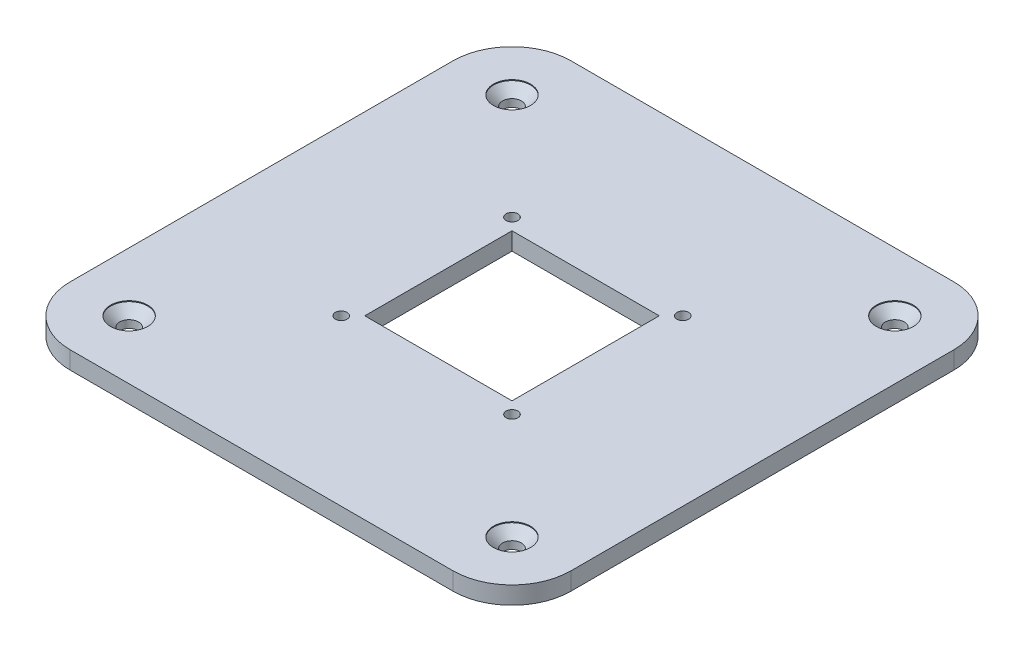
ISO-10303-21;
HEADER;
FILE_DESCRIPTION(('STEP AP214'),'2;1');
FILE_NAME('part.step','',(''),(''),'','','');
FILE_SCHEMA(('AUTOMOTIVE_DESIGN { 1 0 10303 214 1 1 1 1 }'));
ENDSEC;
DATA;
#1=APPLICATION_CONTEXT('core data for automotive mechanical design processes');
#2=APPLICATION_PROTOCOL_DEFINITION('international standard','automotive_design',2000,#1);
#3=PRODUCT_CONTEXT('',#1,'mechanical');
#4=PRODUCT('Part','Part','',(#3));
#5=PRODUCT_RELATED_PRODUCT_CATEGORY('part','',(#4));
#6=PRODUCT_DEFINITION_FORMATION('','',#4);
#7=PRODUCT_DEFINITION_CONTEXT('part definition',#1,'design');
#8=PRODUCT_DEFINITION('design','',#6,#7);
#9=PRODUCT_DEFINITION_SHAPE('','',#8);
#10=(LENGTH_UNIT() NAMED_UNIT(*) SI_UNIT(.MILLI.,.METRE.));
#11=(NAMED_UNIT(*) PLANE_ANGLE_UNIT() SI_UNIT($,.RADIAN.));
#12=(NAMED_UNIT(*) SI_UNIT($,.STERADIAN.) SOLID_ANGLE_UNIT());
#13=UNCERTAINTY_MEASURE_WITH_UNIT(LENGTH_MEASURE(1.E-05),#10,'distance_accuracy_value','');
#14=(GEOMETRIC_REPRESENTATION_CONTEXT(3) GLOBAL_UNCERTAINTY_ASSIGNED_CONTEXT((#13)) GLOBAL_UNIT_ASSIGNED_CONTEXT((#10,
#11,#12)) REPRESENTATION_CONTEXT('',''));
#15=CARTESIAN_POINT('',(0.,0.,0.));
#16=DIRECTION('',(0.,0.,1.));
#17=DIRECTION('',(1.,0.,0.));
#18=AXIS2_PLACEMENT_3D('',#15,#16,#17);
#19=CARTESIAN_POINT('',(42.5,3.,42.5));
#20=DIRECTION('',(-1.,0.,0.));
#21=DIRECTION('',(0.,0.,1.));
#22=AXIS2_PLACEMENT_3D('',#19,#20,#21);
#23=PLANE('',#22);
#24=DIRECTION('',(0.,0.,-1.));
#25=VECTOR('',#24,1.);
#26=CARTESIAN_POINT('',(42.5,0.,42.5));
#27=LINE('',#26,#25);
#28=CARTESIAN_POINT('',(42.5,0.,32.5));
#29=VERTEX_POINT('',#28);
#30=CARTESIAN_POINT('',(42.5,0.,-32.5));
#31=VERTEX_POINT('',#30);
#32=EDGE_CURVE('E126',#29,#31,#27,.T.);
#33=ORIENTED_EDGE('',*,*,#32,.T.);
#34=DIRECTION('',(0.,-1.,0.));
#35=VECTOR('',#34,1.);
#36=CARTESIAN_POINT('',(42.5,3.,-32.5));
#37=LINE('',#36,#35);
#38=CARTESIAN_POINT('',(42.5,3.,-32.5));
#39=VERTEX_POINT('',#38);
#40=EDGE_CURVE('E207',#31,#39,#37,.F.);
#41=ORIENTED_EDGE('',*,*,#40,.T.);
#42=DIRECTION('',(0.,0.,-1.));
#43=VECTOR('',#42,1.);
#44=CARTESIAN_POINT('',(42.5,3.,42.5));
#45=LINE('',#44,#43);
#46=CARTESIAN_POINT('',(42.5,3.,32.5));
#47=VERTEX_POINT('',#46);
#48=EDGE_CURVE('E155',#47,#39,#45,.T.);
#49=ORIENTED_EDGE('',*,*,#48,.F.);
#50=DIRECTION('',(0.,-1.,0.));
#51=VECTOR('',#50,1.);
#52=CARTESIAN_POINT('',(42.5,3.,32.5));
#53=LINE('',#52,#51);
#54=EDGE_CURVE('E204',#47,#29,#53,.T.);
#55=ORIENTED_EDGE('',*,*,#54,.T.);
#56=EDGE_LOOP('',(#33,#41,#49,#55));
#57=FACE_BOUND('',#56,.T.);
#58=ADVANCED_FACE('F32',(#57),#23,.F.);
#59=CARTESIAN_POINT('',(-42.5,3.,-42.5));
#60=DIRECTION('',(0.,0.,1.));
#61=DIRECTION('',(1.,0.,0.));
#62=AXIS2_PLACEMENT_3D('',#59,#60,#61);
#63=PLANE('',#62);
#64=DIRECTION('',(-1.,0.,0.));
#65=VECTOR('',#64,1.);
#66=CARTESIAN_POINT('',(-42.5,0.,-42.5));
#67=LINE('',#66,#65);
#68=CARTESIAN_POINT('',(32.5,0.,-42.5));
#69=VERTEX_POINT('',#68);
#70=CARTESIAN_POINT('',(-32.5,0.,-42.5));
#71=VERTEX_POINT('',#70);
#72=EDGE_CURVE('E171',#69,#71,#67,.T.);
#73=ORIENTED_EDGE('',*,*,#72,.T.);
#74=DIRECTION('',(0.,-1.,0.));
#75=VECTOR('',#74,1.);
#76=CARTESIAN_POINT('',(-32.5,3.,-42.5));
#77=LINE('',#76,#75);
#78=CARTESIAN_POINT('',(-32.5,3.,-42.5));
#79=VERTEX_POINT('',#78);
#80=EDGE_CURVE('E194',#71,#79,#77,.F.);
#81=ORIENTED_EDGE('',*,*,#80,.T.);
#82=DIRECTION('',(-1.,0.,0.));
#83=VECTOR('',#82,1.);
#84=CARTESIAN_POINT('',(-42.5,3.,-42.5));
#85=LINE('',#84,#83);
#86=CARTESIAN_POINT('',(32.5,3.,-42.5));
#87=VERTEX_POINT('',#86);
#88=EDGE_CURVE('E158',#87,#79,#85,.T.);
#89=ORIENTED_EDGE('',*,*,#88,.F.);
#90=DIRECTION('',(0.,-1.,0.));
#91=VECTOR('',#90,1.);
#92=CARTESIAN_POINT('',(32.5,3.,-42.5));
#93=LINE('',#92,#91);
#94=EDGE_CURVE('E191',#87,#69,#93,.T.);
#95=ORIENTED_EDGE('',*,*,#94,.T.);
#96=EDGE_LOOP('',(#73,#81,#89,#95));
#97=FACE_BOUND('',#96,.T.);
#98=ADVANCED_FACE('F235',(#97),#63,.F.);
#99=CARTESIAN_POINT('',(-42.5,3.,42.5));
#100=DIRECTION('',(1.,0.,0.));
#101=DIRECTION('',(0.,0.,-1.));
#102=AXIS2_PLACEMENT_3D('',#99,#100,#101);
#103=PLANE('',#102);
#104=DIRECTION('',(0.,0.,1.));
#105=VECTOR('',#104,1.);
#106=CARTESIAN_POINT('',(-42.5,3.,42.5));
#107=LINE('',#106,#105);
#108=CARTESIAN_POINT('',(-42.5,3.,-32.5));
#109=VERTEX_POINT('',#108);
#110=CARTESIAN_POINT('',(-42.5,3.,32.5));
#111=VERTEX_POINT('',#110);
#112=EDGE_CURVE('E162',#109,#111,#107,.T.);
#113=ORIENTED_EDGE('',*,*,#112,.F.);
#114=DIRECTION('',(0.,-1.,0.));
#115=VECTOR('',#114,1.);
#116=CARTESIAN_POINT('',(-42.5,3.,-32.5));
#117=LINE('',#116,#115);
#118=CARTESIAN_POINT('',(-42.5,0.,-32.5));
#119=VERTEX_POINT('',#118);
#120=EDGE_CURVE('E180',#109,#119,#117,.T.);
#121=ORIENTED_EDGE('',*,*,#120,.T.);
#122=DIRECTION('',(0.,0.,1.));
#123=VECTOR('',#122,1.);
#124=CARTESIAN_POINT('',(-42.5,0.,42.5));
#125=LINE('',#124,#123);
#126=CARTESIAN_POINT('',(-42.5,0.,32.5));
#127=VERTEX_POINT('',#126);
#128=EDGE_CURVE('E174',#119,#127,#125,.T.);
#129=ORIENTED_EDGE('',*,*,#128,.T.);
#130=DIRECTION('',(0.,-1.,0.));
#131=VECTOR('',#130,1.);
#132=CARTESIAN_POINT('',(-42.5,3.,32.5));
#133=LINE('',#132,#131);
#134=EDGE_CURVE('E168',#127,#111,#133,.F.);
#135=ORIENTED_EDGE('',*,*,#134,.T.);
#136=EDGE_LOOP('',(#113,#121,#129,#135));
#137=FACE_BOUND('',#136,.T.);
#138=ADVANCED_FACE('F243',(#137),#103,.F.);
#139=CARTESIAN_POINT('',(-42.5,3.,42.5));
#140=DIRECTION('',(0.,0.,-1.));
#141=DIRECTION('',(-1.,0.,0.));
#142=AXIS2_PLACEMENT_3D('',#139,#140,#141);
#143=PLANE('',#142);
#144=DIRECTION('',(1.,0.,0.));
#145=VECTOR('',#144,1.);
#146=CARTESIAN_POINT('',(-42.5,0.,42.5));
#147=LINE('',#146,#145);
#148=CARTESIAN_POINT('',(-32.5,0.,42.5));
#149=VERTEX_POINT('',#148);
#150=CARTESIAN_POINT('',(32.5,0.,42.5));
#151=VERTEX_POINT('',#150);
#152=EDGE_CURVE('E159',#149,#151,#147,.T.);
#153=ORIENTED_EDGE('',*,*,#152,.T.);
#154=DIRECTION('',(0.,-1.,0.));
#155=VECTOR('',#154,1.);
#156=CARTESIAN_POINT('',(32.5,3.,42.5));
#157=LINE('',#156,#155);
#158=CARTESIAN_POINT('',(32.5,3.,42.5));
#159=VERTEX_POINT('',#158);
#160=EDGE_CURVE('E11',#151,#159,#157,.F.);
#161=ORIENTED_EDGE('',*,*,#160,.T.);
#162=DIRECTION('',(1.,0.,0.));
#163=VECTOR('',#162,1.);
#164=CARTESIAN_POINT('',(-42.5,3.,42.5));
#165=LINE('',#164,#163);
#166=CARTESIAN_POINT('',(-32.5,3.,42.5));
#167=VERTEX_POINT('',#166);
#168=EDGE_CURVE('E165',#167,#159,#165,.T.);
#169=ORIENTED_EDGE('',*,*,#168,.F.);
#170=DIRECTION('',(0.,-1.,0.));
#171=VECTOR('',#170,1.);
#172=CARTESIAN_POINT('',(-32.5,3.,42.5));
#173=LINE('',#172,#171);
#174=EDGE_CURVE('E40',#167,#149,#173,.T.);
#175=ORIENTED_EDGE('',*,*,#174,.T.);
#176=EDGE_LOOP('',(#153,#161,#169,#175));
#177=FACE_BOUND('',#176,.T.);
#178=ADVANCED_FACE('F213',(#177),#143,.F.);
#179=CARTESIAN_POINT('',(0.,3.,0.));
#180=DIRECTION('',(0.,-1.,0.));
#181=DIRECTION('',(0.,0.,-1.));
#182=AXIS2_PLACEMENT_3D('',#179,#180,#181);
#183=PLANE('',#182);
#184=CARTESIAN_POINT('',(-14.4999999999988,3.,14.5));
#185=DIRECTION('',(0.,1.,0.));
#186=DIRECTION('',(0.,0.,1.));
#187=AXIS2_PLACEMENT_3D('',#184,#185,#186);
#188=CIRCLE('',#187,1.);
#189=CARTESIAN_POINT('',(-14.4999999999988,3.,15.5));
#190=VERTEX_POINT('',#189);
#191=EDGE_CURVE('E527',#190,#190,#188,.T.);
#192=ORIENTED_EDGE('',*,*,#191,.F.);
#193=EDGE_LOOP('',(#192));
#194=FACE_BOUND('',#193,.T.);
#195=CARTESIAN_POINT('',(14.5000000000012,3.,14.4999999999988));
#196=DIRECTION('',(0.,1.,0.));
#197=DIRECTION('',(0.,0.,1.));
#198=AXIS2_PLACEMENT_3D('',#195,#196,#197);
#199=CIRCLE('',#198,1.00000000000001);
#200=CARTESIAN_POINT('',(14.5000000000012,3.,15.4999999999988));
#201=VERTEX_POINT('',#200);
#202=EDGE_CURVE('E529',#201,#201,#199,.T.);
#203=ORIENTED_EDGE('',*,*,#202,.F.);
#204=EDGE_LOOP('',(#203));
#205=FACE_BOUND('',#204,.T.);
#206=CARTESIAN_POINT('',(14.5,3.,-14.5000000000012));
#207=DIRECTION('',(0.,1.,0.));
#208=DIRECTION('',(0.,0.,1.));
#209=AXIS2_PLACEMENT_3D('',#206,#207,#208);
#210=CIRCLE('',#209,1.);
#211=CARTESIAN_POINT('',(14.5,3.,-13.5000000000012));
#212=VERTEX_POINT('',#211);
#213=EDGE_CURVE('E535',#212,#212,#210,.T.);
#214=ORIENTED_EDGE('',*,*,#213,.F.);
#215=EDGE_LOOP('',(#214));
#216=FACE_BOUND('',#215,.T.);
#217=CARTESIAN_POINT('',(-14.5,3.,-14.5));
#218=DIRECTION('',(0.,1.,0.));
#219=DIRECTION('',(0.,0.,1.));
#220=AXIS2_PLACEMENT_3D('',#217,#218,#219);
#221=CIRCLE('',#220,1.);
#222=CARTESIAN_POINT('',(-14.5,3.,-13.5));
#223=VERTEX_POINT('',#222);
#224=EDGE_CURVE('E541',#223,#223,#221,.T.);
#225=ORIENTED_EDGE('',*,*,#224,.F.);
#226=EDGE_LOOP('',(#225));
#227=FACE_BOUND('',#226,.T.);
#228=CARTESIAN_POINT('',(32.5,3.,-32.5));
#229=DIRECTION('',(0.,1.,0.));
#230=DIRECTION('',(0.,0.,1.));
#231=AXIS2_PLACEMENT_3D('',#228,#229,#230);
#232=CIRCLE('',#231,3.15);
#233=CARTESIAN_POINT('',(32.5,3.,-29.35));
#234=VERTEX_POINT('',#233);
#235=EDGE_CURVE('E547',#234,#234,#232,.T.);
#236=ORIENTED_EDGE('',*,*,#235,.F.);
#237=EDGE_LOOP('',(#236));
#238=FACE_BOUND('',#237,.T.);
#239=CARTESIAN_POINT('',(32.5,3.,32.5));
#240=DIRECTION('',(0.,1.,0.));
#241=DIRECTION('',(0.,0.,1.));
#242=AXIS2_PLACEMENT_3D('',#239,#240,#241);
#243=CIRCLE('',#242,3.15);
#244=CARTESIAN_POINT('',(32.5,3.,35.65));
#245=VERTEX_POINT('',#244);
#246=EDGE_CURVE('E561',#245,#245,#243,.T.);
#247=ORIENTED_EDGE('',*,*,#246,.F.);
#248=EDGE_LOOP('',(#247));
#249=FACE_BOUND('',#248,.T.);
#250=CARTESIAN_POINT('',(-32.5,3.,32.5));
#251=DIRECTION('',(0.,1.,0.));
#252=DIRECTION('',(0.,0.,1.));
#253=AXIS2_PLACEMENT_3D('',#250,#251,#252);
#254=CIRCLE('',#253,3.15);
#255=CARTESIAN_POINT('',(-32.5,3.,35.65));
#256=VERTEX_POINT('',#255);
#257=EDGE_CURVE('E573',#256,#256,#254,.T.);
#258=ORIENTED_EDGE('',*,*,#257,.F.);
#259=EDGE_LOOP('',(#258));
#260=FACE_BOUND('',#259,.T.);
#261=CARTESIAN_POINT('',(-32.5,3.,-32.5));
#262=DIRECTION('',(0.,1.,0.));
#263=DIRECTION('',(0.,0.,1.));
#264=AXIS2_PLACEMENT_3D('',#261,#262,#263);
#265=CIRCLE('',#264,3.15);
#266=CARTESIAN_POINT('',(-32.5,3.,-29.35));
#267=VERTEX_POINT('',#266);
#268=EDGE_CURVE('E585',#267,#267,#265,.T.);
#269=ORIENTED_EDGE('',*,*,#268,.F.);
#270=EDGE_LOOP('',(#269));
#271=FACE_BOUND('',#270,.T.);
#272=DIRECTION('',(-1.,0.,0.));
#273=VECTOR('',#272,1.);
#274=CARTESIAN_POINT('',(-12.5,3.,-12.5));
#275=LINE('',#274,#273);
#276=CARTESIAN_POINT('',(12.5,3.,-12.5));
#277=VERTEX_POINT('',#276);
#278=CARTESIAN_POINT('',(-12.5,3.,-12.5));
#279=VERTEX_POINT('',#278);
#280=EDGE_CURVE('E139',#277,#279,#275,.T.);
#281=ORIENTED_EDGE('',*,*,#280,.F.);
#282=DIRECTION('',(0.,0.,-1.));
#283=VECTOR('',#282,1.);
#284=CARTESIAN_POINT('',(12.5,3.,12.5));
#285=LINE('',#284,#283);
#286=CARTESIAN_POINT('',(12.5,3.,12.5));
#287=VERTEX_POINT('',#286);
#288=EDGE_CURVE('E47',#287,#277,#285,.T.);
#289=ORIENTED_EDGE('',*,*,#288,.F.);
#290=DIRECTION('',(1.,0.,0.));
#291=VECTOR('',#290,1.);
#292=CARTESIAN_POINT('',(-12.5,3.,12.5));
#293=LINE('',#292,#291);
#294=CARTESIAN_POINT('',(-12.5,3.,12.5));
#295=VERTEX_POINT('',#294);
#296=EDGE_CURVE('E132',#295,#287,#293,.T.);
#297=ORIENTED_EDGE('',*,*,#296,.F.);
#298=DIRECTION('',(0.,0.,1.));
#299=VECTOR('',#298,1.);
#300=CARTESIAN_POINT('',(-12.5,3.,12.5));
#301=LINE('',#300,#299);
#302=EDGE_CURVE('E146',#279,#295,#301,.T.);
#303=ORIENTED_EDGE('',*,*,#302,.F.);
#304=EDGE_LOOP('',(#281,#289,#297,#303));
#305=FACE_BOUND('',#304,.T.);
#306=ORIENTED_EDGE('',*,*,#88,.T.);
#307=CARTESIAN_POINT('',(-32.5,3.,-32.5));
#308=DIRECTION('',(0.,-1.,0.));
#309=DIRECTION('',(0.,0.,-1.));
#310=AXIS2_PLACEMENT_3D('',#307,#308,#309);
#311=CIRCLE('',#310,10.);
#312=EDGE_CURVE('E202',#79,#109,#311,.F.);
#313=ORIENTED_EDGE('',*,*,#312,.T.);
#314=ORIENTED_EDGE('',*,*,#112,.T.);
#315=CARTESIAN_POINT('',(-32.5,3.,32.5));
#316=DIRECTION('',(0.,-1.,0.));
#317=DIRECTION('',(0.,0.,-1.));
#318=AXIS2_PLACEMENT_3D('',#315,#316,#317);
#319=CIRCLE('',#318,10.);
#320=EDGE_CURVE('E196',#111,#167,#319,.F.);
#321=ORIENTED_EDGE('',*,*,#320,.T.);
#322=ORIENTED_EDGE('',*,*,#168,.T.);
#323=CARTESIAN_POINT('',(32.5,3.,32.5));
#324=DIRECTION('',(0.,-1.,0.));
#325=DIRECTION('',(0.,0.,-1.));
#326=AXIS2_PLACEMENT_3D('',#323,#324,#325);
#327=CIRCLE('',#326,10.);
#328=EDGE_CURVE('E198',#159,#47,#327,.F.);
#329=ORIENTED_EDGE('',*,*,#328,.T.);
#330=ORIENTED_EDGE('',*,*,#48,.T.);
#331=CARTESIAN_POINT('',(32.5,3.,-32.5));
#332=DIRECTION('',(0.,-1.,0.));
#333=DIRECTION('',(0.,0.,-1.));
#334=AXIS2_PLACEMENT_3D('',#331,#332,#333);
#335=CIRCLE('',#334,10.);
#336=EDGE_CURVE('E200',#39,#87,#335,.F.);
#337=ORIENTED_EDGE('',*,*,#336,.T.);
#338=EDGE_LOOP('',(#306,#313,#314,#321,#322,#329,#330,#337));
#339=FACE_BOUND('',#338,.T.);
#340=ADVANCED_FACE('F228',(#194,#205,#216,#227,#238,#249,#260,#271,#305,#339),#183,.F.);
#341=CARTESIAN_POINT('',(0.,0.,0.));
#342=DIRECTION('',(0.,-1.,0.));
#343=DIRECTION('',(0.,0.,-1.));
#344=AXIS2_PLACEMENT_3D('',#341,#342,#343);
#345=PLANE('',#344);
#346=CARTESIAN_POINT('',(-14.4999999999988,0.,14.5));
#347=DIRECTION('',(0.,1.,0.));
#348=DIRECTION('',(0.,0.,1.));
#349=AXIS2_PLACEMENT_3D('',#346,#347,#348);
#350=CIRCLE('',#349,1.);
#351=CARTESIAN_POINT('',(-14.4999999999988,0.,15.5));
#352=VERTEX_POINT('',#351);
#353=EDGE_CURVE('E524',#352,#352,#350,.T.);
#354=ORIENTED_EDGE('',*,*,#353,.T.);
#355=EDGE_LOOP('',(#354));
#356=FACE_BOUND('',#355,.T.);
#357=CARTESIAN_POINT('',(14.5000000000012,0.,14.4999999999988));
#358=DIRECTION('',(0.,1.,0.));
#359=DIRECTION('',(0.,0.,1.));
#360=AXIS2_PLACEMENT_3D('',#357,#358,#359);
#361=CIRCLE('',#360,1.00000000000001);
#362=CARTESIAN_POINT('',(14.5000000000012,0.,15.4999999999988));
#363=VERTEX_POINT('',#362);
#364=EDGE_CURVE('E532',#363,#363,#361,.T.);
#365=ORIENTED_EDGE('',*,*,#364,.T.);
#366=EDGE_LOOP('',(#365));
#367=FACE_BOUND('',#366,.T.);
#368=CARTESIAN_POINT('',(14.5,0.,-14.5000000000012));
#369=DIRECTION('',(0.,1.,0.));
#370=DIRECTION('',(0.,0.,1.));
#371=AXIS2_PLACEMENT_3D('',#368,#369,#370);
#372=CIRCLE('',#371,1.);
#373=CARTESIAN_POINT('',(14.5,0.,-13.5000000000012));
#374=VERTEX_POINT('',#373);
#375=EDGE_CURVE('E538',#374,#374,#372,.T.);
#376=ORIENTED_EDGE('',*,*,#375,.T.);
#377=EDGE_LOOP('',(#376));
#378=FACE_BOUND('',#377,.T.);
#379=CARTESIAN_POINT('',(-14.5,0.,-14.5));
#380=DIRECTION('',(0.,1.,0.));
#381=DIRECTION('',(0.,0.,1.));
#382=AXIS2_PLACEMENT_3D('',#379,#380,#381);
#383=CIRCLE('',#382,1.);
#384=CARTESIAN_POINT('',(-14.5,0.,-13.5));
#385=VERTEX_POINT('',#384);
#386=EDGE_CURVE('E544',#385,#385,#383,.T.);
#387=ORIENTED_EDGE('',*,*,#386,.T.);
#388=EDGE_LOOP('',(#387));
#389=FACE_BOUND('',#388,.T.);
#390=CARTESIAN_POINT('',(32.5,0.,-32.5));
#391=DIRECTION('',(0.,-1.,0.));
#392=DIRECTION('',(0.,0.,-1.));
#393=AXIS2_PLACEMENT_3D('',#390,#391,#392);
#394=CIRCLE('',#393,1.6);
#395=CARTESIAN_POINT('',(32.5,0.,-34.1));
#396=VERTEX_POINT('',#395);
#397=EDGE_CURVE('E558',#396,#396,#394,.T.);
#398=ORIENTED_EDGE('',*,*,#397,.F.);
#399=EDGE_LOOP('',(#398));
#400=FACE_BOUND('',#399,.T.);
#401=CARTESIAN_POINT('',(32.5,0.,32.5));
#402=DIRECTION('',(0.,-1.,0.));
#403=DIRECTION('',(0.,0.,-1.));
#404=AXIS2_PLACEMENT_3D('',#401,#402,#403);
#405=CIRCLE('',#404,1.6);
#406=CARTESIAN_POINT('',(32.5,0.,30.9));
#407=VERTEX_POINT('',#406);
#408=EDGE_CURVE('E570',#407,#407,#405,.T.);
#409=ORIENTED_EDGE('',*,*,#408,.F.);
#410=EDGE_LOOP('',(#409));
#411=FACE_BOUND('',#410,.T.);
#412=CARTESIAN_POINT('',(-32.5,0.,32.5));
#413=DIRECTION('',(0.,-1.,0.));
#414=DIRECTION('',(0.,0.,-1.));
#415=AXIS2_PLACEMENT_3D('',#412,#413,#414);
#416=CIRCLE('',#415,1.6);
#417=CARTESIAN_POINT('',(-32.5,0.,30.9));
#418=VERTEX_POINT('',#417);
#419=EDGE_CURVE('E582',#418,#418,#416,.T.);
#420=ORIENTED_EDGE('',*,*,#419,.F.);
#421=EDGE_LOOP('',(#420));
#422=FACE_BOUND('',#421,.T.);
#423=CARTESIAN_POINT('',(-32.5,0.,-32.5));
#424=DIRECTION('',(0.,-1.,0.));
#425=DIRECTION('',(0.,0.,-1.));
#426=AXIS2_PLACEMENT_3D('',#423,#424,#425);
#427=CIRCLE('',#426,1.6);
#428=CARTESIAN_POINT('',(-32.5,0.,-34.1));
#429=VERTEX_POINT('',#428);
#430=EDGE_CURVE('E594',#429,#429,#427,.T.);
#431=ORIENTED_EDGE('',*,*,#430,.F.);
#432=EDGE_LOOP('',(#431));
#433=FACE_BOUND('',#432,.T.);
#434=DIRECTION('',(0.,0.,-1.));
#435=VECTOR('',#434,1.);
#436=CARTESIAN_POINT('',(12.5,0.,12.5));
#437=LINE('',#436,#435);
#438=CARTESIAN_POINT('',(12.5,0.,12.5));
#439=VERTEX_POINT('',#438);
#440=CARTESIAN_POINT('',(12.5,0.,-12.5));
#441=VERTEX_POINT('',#440);
#442=EDGE_CURVE('E130',#439,#441,#437,.T.);
#443=ORIENTED_EDGE('',*,*,#442,.T.);
#444=DIRECTION('',(-1.,0.,0.));
#445=VECTOR('',#444,1.);
#446=CARTESIAN_POINT('',(-12.5,0.,-12.5));
#447=LINE('',#446,#445);
#448=CARTESIAN_POINT('',(-12.5,0.,-12.5));
#449=VERTEX_POINT('',#448);
#450=EDGE_CURVE('E119',#441,#449,#447,.T.);
#451=ORIENTED_EDGE('',*,*,#450,.T.);
#452=DIRECTION('',(0.,0.,1.));
#453=VECTOR('',#452,1.);
#454=CARTESIAN_POINT('',(-12.5,0.,12.5));
#455=LINE('',#454,#453);
#456=CARTESIAN_POINT('',(-12.5,0.,12.5));
#457=VERTEX_POINT('',#456);
#458=EDGE_CURVE('E141',#449,#457,#455,.T.);
#459=ORIENTED_EDGE('',*,*,#458,.T.);
#460=DIRECTION('',(1.,0.,0.));
#461=VECTOR('',#460,1.);
#462=CARTESIAN_POINT('',(-12.5,0.,12.5));
#463=LINE('',#462,#461);
#464=EDGE_CURVE('E137',#457,#439,#463,.T.);
#465=ORIENTED_EDGE('',*,*,#464,.T.);
#466=EDGE_LOOP('',(#443,#451,#459,#465));
#467=FACE_BOUND('',#466,.T.);
#468=ORIENTED_EDGE('',*,*,#128,.F.);
#469=CARTESIAN_POINT('',(-32.5,0.,-32.5));
#470=DIRECTION('',(0.,-1.,0.));
#471=DIRECTION('',(0.,0.,-1.));
#472=AXIS2_PLACEMENT_3D('',#469,#470,#471);
#473=CIRCLE('',#472,10.);
#474=EDGE_CURVE('E189',#119,#71,#473,.T.);
#475=ORIENTED_EDGE('',*,*,#474,.T.);
#476=ORIENTED_EDGE('',*,*,#72,.F.);
#477=CARTESIAN_POINT('',(32.5,0.,-32.5));
#478=DIRECTION('',(0.,-1.,0.));
#479=DIRECTION('',(0.,0.,-1.));
#480=AXIS2_PLACEMENT_3D('',#477,#478,#479);
#481=CIRCLE('',#480,10.);
#482=EDGE_CURVE('E187',#69,#31,#481,.T.);
#483=ORIENTED_EDGE('',*,*,#482,.T.);
#484=ORIENTED_EDGE('',*,*,#32,.F.);
#485=CARTESIAN_POINT('',(32.5,0.,32.5));
#486=DIRECTION('',(0.,-1.,0.));
#487=DIRECTION('',(0.,0.,-1.));
#488=AXIS2_PLACEMENT_3D('',#485,#486,#487);
#489=CIRCLE('',#488,10.);
#490=EDGE_CURVE('E185',#29,#151,#489,.T.);
#491=ORIENTED_EDGE('',*,*,#490,.T.);
#492=ORIENTED_EDGE('',*,*,#152,.F.);
#493=CARTESIAN_POINT('',(-32.5,0.,32.5));
#494=DIRECTION('',(0.,-1.,0.));
#495=DIRECTION('',(0.,0.,-1.));
#496=AXIS2_PLACEMENT_3D('',#493,#494,#495);
#497=CIRCLE('',#496,10.);
#498=EDGE_CURVE('E183',#149,#127,#497,.T.);
#499=ORIENTED_EDGE('',*,*,#498,.T.);
#500=EDGE_LOOP('',(#468,#475,#476,#483,#484,#491,#492,#499));
#501=FACE_BOUND('',#500,.T.);
#502=ADVANCED_FACE('F135',(#356,#367,#378,#389,#400,#411,#422,#433,#467,#501),#345,.T.);
#503=CARTESIAN_POINT('',(-32.5,3.,-32.5));
#504=DIRECTION('',(0.,-1.,0.));
#505=DIRECTION('',(0.,0.,-1.));
#506=AXIS2_PLACEMENT_3D('',#503,#504,#505);
#507=CYLINDRICAL_SURFACE('',#506,10.);
#508=ORIENTED_EDGE('',*,*,#312,.F.);
#509=ORIENTED_EDGE('',*,*,#80,.F.);
#510=ORIENTED_EDGE('',*,*,#474,.F.);
#511=ORIENTED_EDGE('',*,*,#120,.F.);
#512=EDGE_LOOP('',(#508,#509,#510,#511));
#513=FACE_BOUND('',#512,.T.);
#514=ADVANCED_FACE('F240',(#513),#507,.T.);
#515=CARTESIAN_POINT('',(32.5,3.,-32.5));
#516=DIRECTION('',(0.,-1.,0.));
#517=DIRECTION('',(0.,0.,-1.));
#518=AXIS2_PLACEMENT_3D('',#515,#516,#517);
#519=CYLINDRICAL_SURFACE('',#518,10.);
#520=ORIENTED_EDGE('',*,*,#336,.F.);
#521=ORIENTED_EDGE('',*,*,#40,.F.);
#522=ORIENTED_EDGE('',*,*,#482,.F.);
#523=ORIENTED_EDGE('',*,*,#94,.F.);
#524=EDGE_LOOP('',(#520,#521,#522,#523));
#525=FACE_BOUND('',#524,.T.);
#526=ADVANCED_FACE('F232',(#525),#519,.T.);
#527=CARTESIAN_POINT('',(32.5,3.,32.5));
#528=DIRECTION('',(0.,-1.,0.));
#529=DIRECTION('',(0.,0.,-1.));
#530=AXIS2_PLACEMENT_3D('',#527,#528,#529);
#531=CYLINDRICAL_SURFACE('',#530,10.);
#532=ORIENTED_EDGE('',*,*,#328,.F.);
#533=ORIENTED_EDGE('',*,*,#160,.F.);
#534=ORIENTED_EDGE('',*,*,#490,.F.);
#535=ORIENTED_EDGE('',*,*,#54,.F.);
#536=EDGE_LOOP('',(#532,#533,#534,#535));
#537=FACE_BOUND('',#536,.T.);
#538=ADVANCED_FACE('F222',(#537),#531,.T.);
#539=CARTESIAN_POINT('',(-32.5,3.,32.5));
#540=DIRECTION('',(0.,-1.,0.));
#541=DIRECTION('',(0.,0.,-1.));
#542=AXIS2_PLACEMENT_3D('',#539,#540,#541);
#543=CYLINDRICAL_SURFACE('',#542,10.);
#544=ORIENTED_EDGE('',*,*,#320,.F.);
#545=ORIENTED_EDGE('',*,*,#134,.F.);
#546=ORIENTED_EDGE('',*,*,#498,.F.);
#547=ORIENTED_EDGE('',*,*,#174,.F.);
#548=EDGE_LOOP('',(#544,#545,#546,#547));
#549=FACE_BOUND('',#548,.T.);
#550=ADVANCED_FACE('F34',(#549),#543,.T.);
#551=CARTESIAN_POINT('',(12.5,-0.00100000000000013,12.5));
#552=DIRECTION('',(1.,0.,0.));
#553=DIRECTION('',(0.,0.,-1.));
#554=AXIS2_PLACEMENT_3D('',#551,#552,#553);
#555=PLANE('',#554);
#556=DIRECTION('',(0.,1.,0.));
#557=VECTOR('',#556,1.);
#558=CARTESIAN_POINT('',(12.5,-0.00100000000000013,12.5));
#559=LINE('',#558,#557);
#560=EDGE_CURVE('E127',#439,#287,#559,.T.);
#561=ORIENTED_EDGE('',*,*,#560,.T.);
#562=ORIENTED_EDGE('',*,*,#288,.T.);
#563=DIRECTION('',(0.,1.,0.));
#564=VECTOR('',#563,1.);
#565=CARTESIAN_POINT('',(12.5,-0.00100000000000013,-12.5));
#566=LINE('',#565,#564);
#567=EDGE_CURVE('E121',#441,#277,#566,.T.);
#568=ORIENTED_EDGE('',*,*,#567,.F.);
#569=ORIENTED_EDGE('',*,*,#442,.F.);
#570=EDGE_LOOP('',(#561,#562,#568,#569));
#571=FACE_BOUND('',#570,.T.);
#572=ADVANCED_FACE('F129',(#571),#555,.F.);
#573=CARTESIAN_POINT('',(-12.5,-0.00100000000000013,12.5));
#574=DIRECTION('',(0.,0.,1.));
#575=DIRECTION('',(1.,0.,0.));
#576=AXIS2_PLACEMENT_3D('',#573,#574,#575);
#577=PLANE('',#576);
#578=DIRECTION('',(0.,1.,0.));
#579=VECTOR('',#578,1.);
#580=CARTESIAN_POINT('',(-12.5,-0.00100000000000013,12.5));
#581=LINE('',#580,#579);
#582=EDGE_CURVE('E152',#457,#295,#581,.T.);
#583=ORIENTED_EDGE('',*,*,#582,.T.);
#584=ORIENTED_EDGE('',*,*,#296,.T.);
#585=ORIENTED_EDGE('',*,*,#560,.F.);
#586=ORIENTED_EDGE('',*,*,#464,.F.);
#587=EDGE_LOOP('',(#583,#584,#585,#586));
#588=FACE_BOUND('',#587,.T.);
#589=ADVANCED_FACE('F250',(#588),#577,.F.);
#590=CARTESIAN_POINT('',(-12.5,-0.00100000000000013,12.5));
#591=DIRECTION('',(-1.,0.,0.));
#592=DIRECTION('',(0.,0.,1.));
#593=AXIS2_PLACEMENT_3D('',#590,#591,#592);
#594=PLANE('',#593);
#595=DIRECTION('',(0.,1.,0.));
#596=VECTOR('',#595,1.);
#597=CARTESIAN_POINT('',(-12.5,-0.00100000000000013,-12.5));
#598=LINE('',#597,#596);
#599=EDGE_CURVE('E55',#449,#279,#598,.T.);
#600=ORIENTED_EDGE('',*,*,#599,.T.);
#601=ORIENTED_EDGE('',*,*,#302,.T.);
#602=ORIENTED_EDGE('',*,*,#582,.F.);
#603=ORIENTED_EDGE('',*,*,#458,.F.);
#604=EDGE_LOOP('',(#600,#601,#602,#603));
#605=FACE_BOUND('',#604,.T.);
#606=ADVANCED_FACE('F291',(#605),#594,.F.);
#607=CARTESIAN_POINT('',(-12.5,-0.00100000000000013,-12.5));
#608=DIRECTION('',(0.,0.,-1.));
#609=DIRECTION('',(-1.,0.,0.));
#610=AXIS2_PLACEMENT_3D('',#607,#608,#609);
#611=PLANE('',#610);
#612=ORIENTED_EDGE('',*,*,#567,.T.);
#613=ORIENTED_EDGE('',*,*,#280,.T.);
#614=ORIENTED_EDGE('',*,*,#599,.F.);
#615=ORIENTED_EDGE('',*,*,#450,.F.);
#616=EDGE_LOOP('',(#612,#613,#614,#615));
#617=FACE_BOUND('',#616,.T.);
#618=ADVANCED_FACE('F120',(#617),#611,.F.);
#619=CARTESIAN_POINT('',(-32.5,3.,-32.5));
#620=DIRECTION('',(0.,1.,0.));
#621=DIRECTION('',(0.,0.,1.));
#622=AXIS2_PLACEMENT_3D('',#619,#620,#621);
#623=CYLINDRICAL_SURFACE('',#622,1.6);
#624=CARTESIAN_POINT('',(-32.5,1.3,-32.5));
#625=DIRECTION('',(0.,1.,0.));
#626=DIRECTION('',(0.,0.,1.));
#627=AXIS2_PLACEMENT_3D('',#624,#625,#626);
#628=CIRCLE('',#627,1.6);
#629=CARTESIAN_POINT('',(-32.5,1.3,-30.9));
#630=VERTEX_POINT('',#629);
#631=EDGE_CURVE('E591',#630,#630,#628,.T.);
#632=ORIENTED_EDGE('',*,*,#631,.T.);
#633=EDGE_LOOP('',(#632));
#634=FACE_BOUND('',#633,.T.);
#635=ORIENTED_EDGE('',*,*,#430,.T.);
#636=EDGE_LOOP('',(#635));
#637=FACE_BOUND('',#636,.T.);
#638=ADVANCED_FACE('F310',(#634,#637),#623,.F.);
#639=CARTESIAN_POINT('',(-32.5,2.85,-32.5));
#640=DIRECTION('',(0.,1.,0.));
#641=DIRECTION('',(0.,0.,1.));
#642=AXIS2_PLACEMENT_3D('',#639,#640,#641);
#643=CONICAL_SURFACE('',#642,3.15,0.785398163397447);
#644=ORIENTED_EDGE('',*,*,#631,.F.);
#645=EDGE_LOOP('',(#644));
#646=FACE_BOUND('',#645,.T.);
#647=CARTESIAN_POINT('',(-32.5,2.85,-32.5));
#648=DIRECTION('',(0.,1.,0.));
#649=DIRECTION('',(0.,0.,1.));
#650=AXIS2_PLACEMENT_3D('',#647,#648,#649);
#651=CIRCLE('',#650,3.15);
#652=CARTESIAN_POINT('',(-32.5,2.85,-29.35));
#653=VERTEX_POINT('',#652);
#654=EDGE_CURVE('E588',#653,#653,#651,.T.);
#655=ORIENTED_EDGE('',*,*,#654,.T.);
#656=EDGE_LOOP('',(#655));
#657=FACE_BOUND('',#656,.T.);
#658=ADVANCED_FACE('F319',(#646,#657),#643,.F.);
#659=CARTESIAN_POINT('',(-32.5,3.,-32.5));
#660=DIRECTION('',(0.,1.,0.));
#661=DIRECTION('',(0.,0.,1.));
#662=AXIS2_PLACEMENT_3D('',#659,#660,#661);
#663=CYLINDRICAL_SURFACE('',#662,3.15);
#664=ORIENTED_EDGE('',*,*,#654,.F.);
#665=EDGE_LOOP('',(#664));
#666=FACE_BOUND('',#665,.T.);
#667=ORIENTED_EDGE('',*,*,#268,.T.);
#668=EDGE_LOOP('',(#667));
#669=FACE_BOUND('',#668,.T.);
#670=ADVANCED_FACE('F329',(#666,#669),#663,.F.);
#671=CARTESIAN_POINT('',(-32.5,3.,32.5));
#672=DIRECTION('',(0.,1.,0.));
#673=DIRECTION('',(0.,0.,1.));
#674=AXIS2_PLACEMENT_3D('',#671,#672,#673);
#675=CYLINDRICAL_SURFACE('',#674,1.6);
#676=CARTESIAN_POINT('',(-32.5,1.3,32.5));
#677=DIRECTION('',(0.,1.,0.));
#678=DIRECTION('',(0.,0.,1.));
#679=AXIS2_PLACEMENT_3D('',#676,#677,#678);
#680=CIRCLE('',#679,1.6);
#681=CARTESIAN_POINT('',(-32.5,1.3,34.1));
#682=VERTEX_POINT('',#681);
#683=EDGE_CURVE('E579',#682,#682,#680,.T.);
#684=ORIENTED_EDGE('',*,*,#683,.T.);
#685=EDGE_LOOP('',(#684));
#686=FACE_BOUND('',#685,.T.);
#687=ORIENTED_EDGE('',*,*,#419,.T.);
#688=EDGE_LOOP('',(#687));
#689=FACE_BOUND('',#688,.T.);
#690=ADVANCED_FACE('F339',(#686,#689),#675,.F.);
#691=CARTESIAN_POINT('',(-32.5,2.85,32.5));
#692=DIRECTION('',(0.,1.,0.));
#693=DIRECTION('',(0.,0.,1.));
#694=AXIS2_PLACEMENT_3D('',#691,#692,#693);
#695=CONICAL_SURFACE('',#694,3.15,0.785398163397447);
#696=ORIENTED_EDGE('',*,*,#683,.F.);
#697=EDGE_LOOP('',(#696));
#698=FACE_BOUND('',#697,.T.);
#699=CARTESIAN_POINT('',(-32.5,2.85,32.5));
#700=DIRECTION('',(0.,1.,0.));
#701=DIRECTION('',(0.,0.,1.));
#702=AXIS2_PLACEMENT_3D('',#699,#700,#701);
#703=CIRCLE('',#702,3.15);
#704=CARTESIAN_POINT('',(-32.5,2.85,35.65));
#705=VERTEX_POINT('',#704);
#706=EDGE_CURVE('E576',#705,#705,#703,.T.);
#707=ORIENTED_EDGE('',*,*,#706,.T.);
#708=EDGE_LOOP('',(#707));
#709=FACE_BOUND('',#708,.T.);
#710=ADVANCED_FACE('F349',(#698,#709),#695,.F.);
#711=CARTESIAN_POINT('',(-32.5,3.,32.5));
#712=DIRECTION('',(0.,1.,0.));
#713=DIRECTION('',(0.,0.,1.));
#714=AXIS2_PLACEMENT_3D('',#711,#712,#713);
#715=CYLINDRICAL_SURFACE('',#714,3.15);
#716=ORIENTED_EDGE('',*,*,#706,.F.);
#717=EDGE_LOOP('',(#716));
#718=FACE_BOUND('',#717,.T.);
#719=ORIENTED_EDGE('',*,*,#257,.T.);
#720=EDGE_LOOP('',(#719));
#721=FACE_BOUND('',#720,.T.);
#722=ADVANCED_FACE('F359',(#718,#721),#715,.F.);
#723=CARTESIAN_POINT('',(32.5,3.,32.5));
#724=DIRECTION('',(0.,1.,0.));
#725=DIRECTION('',(0.,0.,1.));
#726=AXIS2_PLACEMENT_3D('',#723,#724,#725);
#727=CYLINDRICAL_SURFACE('',#726,1.6);
#728=CARTESIAN_POINT('',(32.5,1.3,32.5));
#729=DIRECTION('',(0.,1.,0.));
#730=DIRECTION('',(0.,0.,1.));
#731=AXIS2_PLACEMENT_3D('',#728,#729,#730);
#732=CIRCLE('',#731,1.6);
#733=CARTESIAN_POINT('',(32.5,1.3,34.1));
#734=VERTEX_POINT('',#733);
#735=EDGE_CURVE('E567',#734,#734,#732,.T.);
#736=ORIENTED_EDGE('',*,*,#735,.T.);
#737=EDGE_LOOP('',(#736));
#738=FACE_BOUND('',#737,.T.);
#739=ORIENTED_EDGE('',*,*,#408,.T.);
#740=EDGE_LOOP('',(#739));
#741=FACE_BOUND('',#740,.T.);
#742=ADVANCED_FACE('F369',(#738,#741),#727,.F.);
#743=CARTESIAN_POINT('',(32.5,2.85,32.5));
#744=DIRECTION('',(0.,1.,0.));
#745=DIRECTION('',(0.,0.,1.));
#746=AXIS2_PLACEMENT_3D('',#743,#744,#745);
#747=CONICAL_SURFACE('',#746,3.14999999999999,0.785398163397447);
#748=ORIENTED_EDGE('',*,*,#735,.F.);
#749=EDGE_LOOP('',(#748));
#750=FACE_BOUND('',#749,.T.);
#751=CARTESIAN_POINT('',(32.5,2.85,32.5));
#752=DIRECTION('',(0.,1.,0.));
#753=DIRECTION('',(0.,0.,1.));
#754=AXIS2_PLACEMENT_3D('',#751,#752,#753);
#755=CIRCLE('',#754,3.14999999999999);
#756=CARTESIAN_POINT('',(32.5,2.85,35.65));
#757=VERTEX_POINT('',#756);
#758=EDGE_CURVE('E564',#757,#757,#755,.T.);
#759=ORIENTED_EDGE('',*,*,#758,.T.);
#760=EDGE_LOOP('',(#759));
#761=FACE_BOUND('',#760,.T.);
#762=ADVANCED_FACE('F379',(#750,#761),#747,.F.);
#763=CARTESIAN_POINT('',(32.5,3.,32.5));
#764=DIRECTION('',(0.,1.,0.));
#765=DIRECTION('',(0.,0.,1.));
#766=AXIS2_PLACEMENT_3D('',#763,#764,#765);
#767=CYLINDRICAL_SURFACE('',#766,3.15);
#768=ORIENTED_EDGE('',*,*,#758,.F.);
#769=EDGE_LOOP('',(#768));
#770=FACE_BOUND('',#769,.T.);
#771=ORIENTED_EDGE('',*,*,#246,.T.);
#772=EDGE_LOOP('',(#771));
#773=FACE_BOUND('',#772,.T.);
#774=ADVANCED_FACE('F389',(#770,#773),#767,.F.);
#775=CARTESIAN_POINT('',(32.5,3.,-32.5));
#776=DIRECTION('',(0.,1.,0.));
#777=DIRECTION('',(0.,0.,1.));
#778=AXIS2_PLACEMENT_3D('',#775,#776,#777);
#779=CYLINDRICAL_SURFACE('',#778,1.6);
#780=CARTESIAN_POINT('',(32.5,1.3,-32.5));
#781=DIRECTION('',(0.,1.,0.));
#782=DIRECTION('',(0.,0.,1.));
#783=AXIS2_PLACEMENT_3D('',#780,#781,#782);
#784=CIRCLE('',#783,1.6);
#785=CARTESIAN_POINT('',(32.5,1.3,-30.9));
#786=VERTEX_POINT('',#785);
#787=EDGE_CURVE('E555',#786,#786,#784,.T.);
#788=ORIENTED_EDGE('',*,*,#787,.T.);
#789=EDGE_LOOP('',(#788));
#790=FACE_BOUND('',#789,.T.);
#791=ORIENTED_EDGE('',*,*,#397,.T.);
#792=EDGE_LOOP('',(#791));
#793=FACE_BOUND('',#792,.T.);
#794=ADVANCED_FACE('F399',(#790,#793),#779,.F.);
#795=CARTESIAN_POINT('',(32.5,2.85,-32.5));
#796=DIRECTION('',(0.,1.,0.));
#797=DIRECTION('',(0.,0.,1.));
#798=AXIS2_PLACEMENT_3D('',#795,#796,#797);
#799=CONICAL_SURFACE('',#798,3.15,0.785398163397449);
#800=ORIENTED_EDGE('',*,*,#787,.F.);
#801=EDGE_LOOP('',(#800));
#802=FACE_BOUND('',#801,.T.);
#803=CARTESIAN_POINT('',(32.5,2.85,-32.5));
#804=DIRECTION('',(0.,1.,0.));
#805=DIRECTION('',(0.,0.,1.));
#806=AXIS2_PLACEMENT_3D('',#803,#804,#805);
#807=CIRCLE('',#806,3.15);
#808=CARTESIAN_POINT('',(32.5,2.85,-29.35));
#809=VERTEX_POINT('',#808);
#810=EDGE_CURVE('E552',#809,#809,#807,.T.);
#811=ORIENTED_EDGE('',*,*,#810,.T.);
#812=EDGE_LOOP('',(#811));
#813=FACE_BOUND('',#812,.T.);
#814=ADVANCED_FACE('F409',(#802,#813),#799,.F.);
#815=CARTESIAN_POINT('',(32.5,3.,-32.5));
#816=DIRECTION('',(0.,1.,0.));
#817=DIRECTION('',(0.,0.,1.));
#818=AXIS2_PLACEMENT_3D('',#815,#816,#817);
#819=CYLINDRICAL_SURFACE('',#818,3.15);
#820=ORIENTED_EDGE('',*,*,#810,.F.);
#821=EDGE_LOOP('',(#820));
#822=FACE_BOUND('',#821,.T.);
#823=ORIENTED_EDGE('',*,*,#235,.T.);
#824=EDGE_LOOP('',(#823));
#825=FACE_BOUND('',#824,.T.);
#826=ADVANCED_FACE('F419',(#822,#825),#819,.F.);
#827=CARTESIAN_POINT('',(-14.5,0.,-14.5));
#828=DIRECTION('',(0.,1.,0.));
#829=DIRECTION('',(0.,0.,1.));
#830=AXIS2_PLACEMENT_3D('',#827,#828,#829);
#831=CYLINDRICAL_SURFACE('',#830,1.);
#832=ORIENTED_EDGE('',*,*,#386,.F.);
#833=EDGE_LOOP('',(#832));
#834=FACE_BOUND('',#833,.T.);
#835=ORIENTED_EDGE('',*,*,#224,.T.);
#836=EDGE_LOOP('',(#835));
#837=FACE_BOUND('',#836,.T.);
#838=ADVANCED_FACE('F429',(#834,#837),#831,.F.);
#839=CARTESIAN_POINT('',(14.5,0.,-14.5000000000012));
#840=DIRECTION('',(0.,1.,0.));
#841=DIRECTION('',(0.,0.,1.));
#842=AXIS2_PLACEMENT_3D('',#839,#840,#841);
#843=CYLINDRICAL_SURFACE('',#842,1.);
#844=ORIENTED_EDGE('',*,*,#375,.F.);
#845=EDGE_LOOP('',(#844));
#846=FACE_BOUND('',#845,.T.);
#847=ORIENTED_EDGE('',*,*,#213,.T.);
#848=EDGE_LOOP('',(#847));
#849=FACE_BOUND('',#848,.T.);
#850=ADVANCED_FACE('F459',(#846,#849),#843,.F.);
#851=CARTESIAN_POINT('',(14.5000000000012,0.,14.4999999999988));
#852=DIRECTION('',(0.,1.,0.));
#853=DIRECTION('',(0.,0.,1.));
#854=AXIS2_PLACEMENT_3D('',#851,#852,#853);
#855=CYLINDRICAL_SURFACE('',#854,1.00000000000001);
#856=ORIENTED_EDGE('',*,*,#364,.F.);
#857=EDGE_LOOP('',(#856));
#858=FACE_BOUND('',#857,.T.);
#859=ORIENTED_EDGE('',*,*,#202,.T.);
#860=EDGE_LOOP('',(#859));
#861=FACE_BOUND('',#860,.T.);
#862=ADVANCED_FACE('F469',(#858,#861),#855,.F.);
#863=CARTESIAN_POINT('',(-14.4999999999988,0.,14.5));
#864=DIRECTION('',(0.,1.,0.));
#865=DIRECTION('',(0.,0.,1.));
#866=AXIS2_PLACEMENT_3D('',#863,#864,#865);
#867=CYLINDRICAL_SURFACE('',#866,1.);
#868=ORIENTED_EDGE('',*,*,#353,.F.);
#869=EDGE_LOOP('',(#868));
#870=FACE_BOUND('',#869,.T.);
#871=ORIENTED_EDGE('',*,*,#191,.T.);
#872=EDGE_LOOP('',(#871));
#873=FACE_BOUND('',#872,.T.);
#874=ADVANCED_FACE('F479',(#870,#873),#867,.F.);
#875=CLOSED_SHELL('',(#58,#98,#138,#178,#340,#502,#514,#526,#538,#550,#572,#589,#606,#618,#638,
#658,#670,#690,#710,#722,#742,#762,#774,#794,#814,#826,#838,#850,#862,#874));
#876=MANIFOLD_SOLID_BREP('B2',#875);
#877=ADVANCED_BREP_SHAPE_REPRESENTATION('',(#18,#876),#14);
#878=SHAPE_DEFINITION_REPRESENTATION(#9,#877);
ENDSEC;
END-ISO-10303-21;
